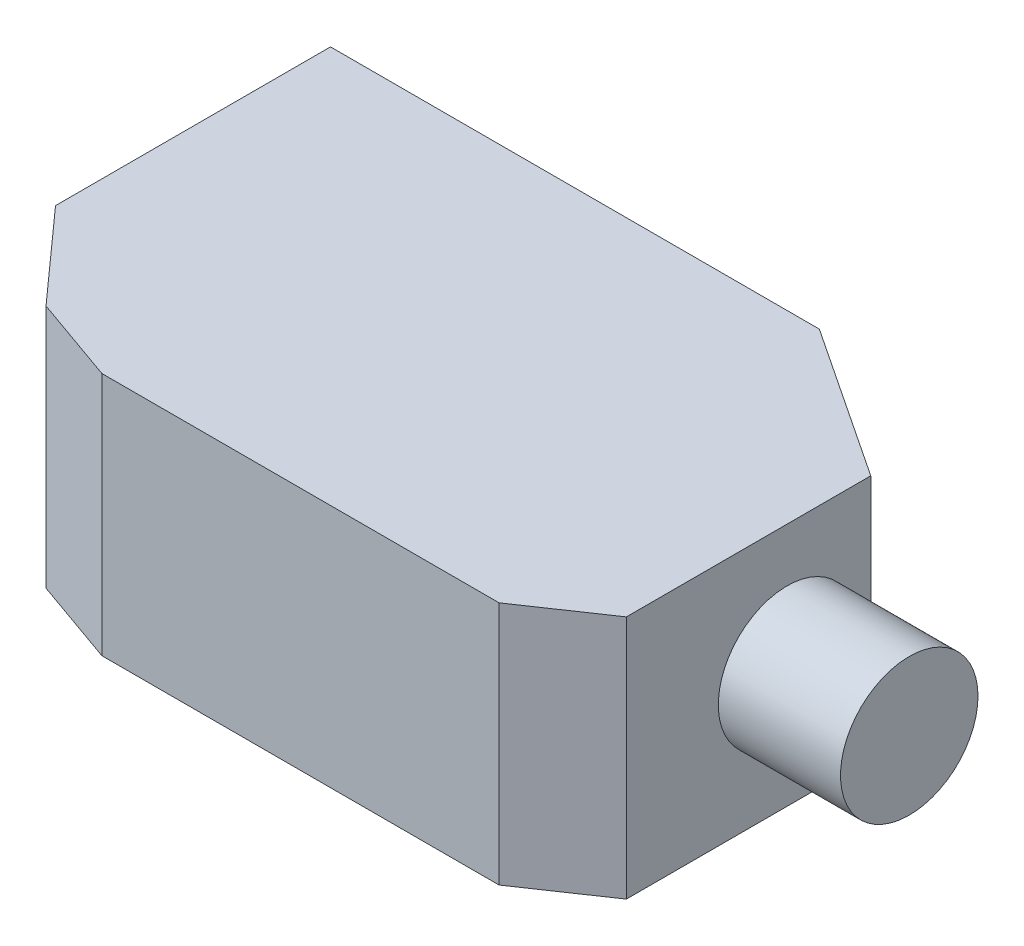
ISO-10303-21;
HEADER;
FILE_DESCRIPTION(('STEP AP214'),'2;1');
FILE_NAME('part.step','',(''),(''),'','','');
FILE_SCHEMA(('AUTOMOTIVE_DESIGN { 1 0 10303 214 1 1 1 1 }'));
ENDSEC;
DATA;
#1=APPLICATION_CONTEXT('core data for automotive mechanical design processes');
#2=APPLICATION_PROTOCOL_DEFINITION('international standard','automotive_design',2000,#1);
#3=PRODUCT_CONTEXT('',#1,'mechanical');
#4=PRODUCT('Part','Part','',(#3));
#5=PRODUCT_RELATED_PRODUCT_CATEGORY('part','',(#4));
#6=PRODUCT_DEFINITION_FORMATION('','',#4);
#7=PRODUCT_DEFINITION_CONTEXT('part definition',#1,'design');
#8=PRODUCT_DEFINITION('design','',#6,#7);
#9=PRODUCT_DEFINITION_SHAPE('','',#8);
#10=(LENGTH_UNIT() NAMED_UNIT(*) SI_UNIT(.MILLI.,.METRE.));
#11=(NAMED_UNIT(*) PLANE_ANGLE_UNIT() SI_UNIT($,.RADIAN.));
#12=(NAMED_UNIT(*) SI_UNIT($,.STERADIAN.) SOLID_ANGLE_UNIT());
#13=UNCERTAINTY_MEASURE_WITH_UNIT(LENGTH_MEASURE(1.E-05),#10,'distance_accuracy_value','');
#14=(GEOMETRIC_REPRESENTATION_CONTEXT(3) GLOBAL_UNCERTAINTY_ASSIGNED_CONTEXT((#13)) GLOBAL_UNIT_ASSIGNED_CONTEXT((#10,
#11,#12)) REPRESENTATION_CONTEXT('',''));
#15=CARTESIAN_POINT('',(0.,0.,0.));
#16=DIRECTION('',(0.,0.,1.));
#17=DIRECTION('',(1.,0.,0.));
#18=AXIS2_PLACEMENT_3D('',#15,#16,#17);
#19=CARTESIAN_POINT('',(0.,12.7,0.));
#20=DIRECTION('',(1.,0.,0.));
#21=DIRECTION('',(0.,0.,-1.));
#22=AXIS2_PLACEMENT_3D('',#19,#20,#21);
#23=PLANE('',#22);
#24=DIRECTION('',(0.,0.,1.));
#25=VECTOR('',#24,1.);
#26=CARTESIAN_POINT('',(0.,0.,0.));
#27=LINE('',#26,#25);
#28=CARTESIAN_POINT('',(0.,0.,0.));
#29=VERTEX_POINT('',#28);
#30=CARTESIAN_POINT('',(0.,0.,14.2875));
#31=VERTEX_POINT('',#30);
#32=EDGE_CURVE('E131',#29,#31,#27,.T.);
#33=ORIENTED_EDGE('',*,*,#32,.T.);
#34=DIRECTION('',(0.,-1.,0.));
#35=VECTOR('',#34,1.);
#36=CARTESIAN_POINT('',(0.,12.7,14.2875));
#37=LINE('',#36,#35);
#38=CARTESIAN_POINT('',(0.,12.7,14.2875));
#39=VERTEX_POINT('',#38);
#40=EDGE_CURVE('E36',#39,#31,#37,.T.);
#41=ORIENTED_EDGE('',*,*,#40,.F.);
#42=DIRECTION('',(0.,0.,1.));
#43=VECTOR('',#42,1.);
#44=CARTESIAN_POINT('',(0.,12.7,0.));
#45=LINE('',#44,#43);
#46=CARTESIAN_POINT('',(0.,12.7,0.));
#47=VERTEX_POINT('',#46);
#48=EDGE_CURVE('E146',#47,#39,#45,.T.);
#49=ORIENTED_EDGE('',*,*,#48,.F.);
#50=DIRECTION('',(0.,-1.,0.));
#51=VECTOR('',#50,1.);
#52=CARTESIAN_POINT('',(0.,12.7,0.));
#53=LINE('',#52,#51);
#54=EDGE_CURVE('E127',#47,#29,#53,.T.);
#55=ORIENTED_EDGE('',*,*,#54,.T.);
#56=EDGE_LOOP('',(#33,#41,#49,#55));
#57=FACE_BOUND('',#56,.T.);
#58=ADVANCED_FACE('F33',(#57),#23,.F.);
#59=CARTESIAN_POINT('',(0.,12.7,14.2875));
#60=DIRECTION('',(0.744726782819702,0.,-0.667369477089728));
#61=DIRECTION('',(-0.667369477089728,0.,-0.744726782819702));
#62=AXIS2_PLACEMENT_3D('',#59,#60,#61);
#63=PLANE('',#62);
#64=DIRECTION('',(0.667369477089728,0.,0.744726782819702));
#65=VECTOR('',#64,1.);
#66=CARTESIAN_POINT('',(0.,0.,14.2875));
#67=LINE('',#66,#65);
#68=CARTESIAN_POINT('',(4.26780291505819,0.,19.05));
#69=VERTEX_POINT('',#68);
#70=EDGE_CURVE('E134',#31,#69,#67,.T.);
#71=ORIENTED_EDGE('',*,*,#70,.T.);
#72=DIRECTION('',(0.,-1.,0.));
#73=VECTOR('',#72,1.);
#74=CARTESIAN_POINT('',(4.26780291505819,12.7,19.05));
#75=LINE('',#74,#73);
#76=CARTESIAN_POINT('',(4.26780291505819,12.7,19.05));
#77=VERTEX_POINT('',#76);
#78=EDGE_CURVE('E155',#77,#69,#75,.T.);
#79=ORIENTED_EDGE('',*,*,#78,.F.);
#80=DIRECTION('',(0.667369477089728,0.,0.744726782819702));
#81=VECTOR('',#80,1.);
#82=CARTESIAN_POINT('',(0.,12.7,14.2875));
#83=LINE('',#82,#81);
#84=EDGE_CURVE('E94',#39,#77,#83,.T.);
#85=ORIENTED_EDGE('',*,*,#84,.F.);
#86=ORIENTED_EDGE('',*,*,#40,.T.);
#87=EDGE_LOOP('',(#71,#79,#85,#86));
#88=FACE_BOUND('',#87,.T.);
#89=ADVANCED_FACE('F161',(#88),#63,.F.);
#90=CARTESIAN_POINT('',(8.75793097559277,12.7,20.6375));
#91=DIRECTION('',(0.333333333333333,0.,-0.942809041582064));
#92=DIRECTION('',(-0.942809041582064,0.,-0.333333333333333));
#93=AXIS2_PLACEMENT_3D('',#90,#91,#92);
#94=PLANE('',#93);
#95=DIRECTION('',(0.942809041582064,0.,0.333333333333333));
#96=VECTOR('',#95,1.);
#97=CARTESIAN_POINT('',(8.75793097559277,0.,20.6375));
#98=LINE('',#97,#96);
#99=CARTESIAN_POINT('',(8.75793097559277,0.,20.6375));
#100=VERTEX_POINT('',#99);
#101=EDGE_CURVE('E137',#69,#100,#98,.T.);
#102=ORIENTED_EDGE('',*,*,#101,.T.);
#103=DIRECTION('',(0.,-1.,0.));
#104=VECTOR('',#103,1.);
#105=CARTESIAN_POINT('',(8.75793097559277,12.7,20.6375));
#106=LINE('',#105,#104);
#107=CARTESIAN_POINT('',(8.75793097559277,12.7,20.6375));
#108=VERTEX_POINT('',#107);
#109=EDGE_CURVE('E153',#108,#100,#106,.T.);
#110=ORIENTED_EDGE('',*,*,#109,.F.);
#111=DIRECTION('',(0.942809041582064,0.,0.333333333333333));
#112=VECTOR('',#111,1.);
#113=CARTESIAN_POINT('',(8.75793097559277,12.7,20.6375));
#114=LINE('',#113,#112);
#115=EDGE_CURVE('E176',#77,#108,#114,.T.);
#116=ORIENTED_EDGE('',*,*,#115,.F.);
#117=ORIENTED_EDGE('',*,*,#78,.T.);
#118=EDGE_LOOP('',(#102,#110,#116,#117));
#119=FACE_BOUND('',#118,.T.);
#120=ADVANCED_FACE('F170',(#119),#94,.F.);
#121=CARTESIAN_POINT('',(29.3954309755928,12.7,20.6375));
#122=DIRECTION('',(0.,0.,-1.));
#123=DIRECTION('',(-1.,0.,0.));
#124=AXIS2_PLACEMENT_3D('',#121,#122,#123);
#125=PLANE('',#124);
#126=DIRECTION('',(1.,0.,0.));
#127=VECTOR('',#126,1.);
#128=CARTESIAN_POINT('',(29.3954309755928,0.,20.6375));
#129=LINE('',#128,#127);
#130=CARTESIAN_POINT('',(29.3954309755928,0.,20.6375));
#131=VERTEX_POINT('',#130);
#132=EDGE_CURVE('E139',#100,#131,#129,.T.);
#133=ORIENTED_EDGE('',*,*,#132,.T.);
#134=DIRECTION('',(0.,-1.,0.));
#135=VECTOR('',#134,1.);
#136=CARTESIAN_POINT('',(29.3954309755928,12.7,20.6375));
#137=LINE('',#136,#135);
#138=CARTESIAN_POINT('',(29.3954309755928,12.7,20.6375));
#139=VERTEX_POINT('',#138);
#140=EDGE_CURVE('E150',#139,#131,#137,.T.);
#141=ORIENTED_EDGE('',*,*,#140,.F.);
#142=DIRECTION('',(1.,0.,0.));
#143=VECTOR('',#142,1.);
#144=CARTESIAN_POINT('',(29.3954309755928,12.7,20.6375));
#145=LINE('',#144,#143);
#146=EDGE_CURVE('E175',#108,#139,#145,.T.);
#147=ORIENTED_EDGE('',*,*,#146,.F.);
#148=ORIENTED_EDGE('',*,*,#109,.T.);
#149=EDGE_LOOP('',(#133,#141,#147,#148));
#150=FACE_BOUND('',#149,.T.);
#151=ADVANCED_FACE('F173',(#150),#125,.F.);
#152=CARTESIAN_POINT('',(33.3375,12.7,17.9651418546892));
#153=DIRECTION('',(-0.561125069881533,0.,-0.827731028746926));
#154=DIRECTION('',(-0.827731028746926,0.,0.561125069881533));
#155=AXIS2_PLACEMENT_3D('',#152,#153,#154);
#156=PLANE('',#155);
#157=DIRECTION('',(0.827731028746926,0.,-0.561125069881533));
#158=VECTOR('',#157,1.);
#159=CARTESIAN_POINT('',(33.3375,0.,17.9651418546892));
#160=LINE('',#159,#158);
#161=CARTESIAN_POINT('',(33.3375,0.,17.9651418546892));
#162=VERTEX_POINT('',#161);
#163=EDGE_CURVE('E141',#131,#162,#160,.T.);
#164=ORIENTED_EDGE('',*,*,#163,.T.);
#165=DIRECTION('',(0.,-1.,0.));
#166=VECTOR('',#165,1.);
#167=CARTESIAN_POINT('',(33.3375,12.7,17.9651418546892));
#168=LINE('',#167,#166);
#169=CARTESIAN_POINT('',(33.3375,12.7,17.9651418546892));
#170=VERTEX_POINT('',#169);
#171=EDGE_CURVE('E122',#170,#162,#168,.T.);
#172=ORIENTED_EDGE('',*,*,#171,.F.);
#173=DIRECTION('',(0.827731028746926,0.,-0.561125069881533));
#174=VECTOR('',#173,1.);
#175=CARTESIAN_POINT('',(33.3375,12.7,17.9651418546892));
#176=LINE('',#175,#174);
#177=EDGE_CURVE('E113',#139,#170,#176,.T.);
#178=ORIENTED_EDGE('',*,*,#177,.F.);
#179=ORIENTED_EDGE('',*,*,#140,.T.);
#180=EDGE_LOOP('',(#164,#172,#178,#179));
#181=FACE_BOUND('',#180,.T.);
#182=ADVANCED_FACE('F194',(#181),#156,.F.);
#183=CARTESIAN_POINT('',(33.3375,12.7,5.2651418546892));
#184=DIRECTION('',(-1.,0.,0.));
#185=DIRECTION('',(0.,0.,1.));
#186=AXIS2_PLACEMENT_3D('',#183,#184,#185);
#187=PLANE('',#186);
#188=CARTESIAN_POINT('',(33.3375,6.35,9.6148918546892));
#189=DIRECTION('',(1.,0.,0.));
#190=DIRECTION('',(0.,0.,-1.));
#191=AXIS2_PLACEMENT_3D('',#188,#189,#190);
#192=CIRCLE('',#191,3.571875);
#193=CARTESIAN_POINT('',(33.3375,6.35,6.0430168546892));
#194=VERTEX_POINT('',#193);
#195=EDGE_CURVE('E11',#194,#194,#192,.T.);
#196=ORIENTED_EDGE('',*,*,#195,.F.);
#197=EDGE_LOOP('',(#196));
#198=FACE_BOUND('',#197,.T.);
#199=DIRECTION('',(0.,0.,-1.));
#200=VECTOR('',#199,1.);
#201=CARTESIAN_POINT('',(33.3375,0.,5.2651418546892));
#202=LINE('',#201,#200);
#203=CARTESIAN_POINT('',(33.3375,0.,5.2651418546892));
#204=VERTEX_POINT('',#203);
#205=EDGE_CURVE('E121',#162,#204,#202,.T.);
#206=ORIENTED_EDGE('',*,*,#205,.T.);
#207=DIRECTION('',(0.,-1.,0.));
#208=VECTOR('',#207,1.);
#209=CARTESIAN_POINT('',(33.3375,12.7,5.2651418546892));
#210=LINE('',#209,#208);
#211=CARTESIAN_POINT('',(33.3375,12.7,5.2651418546892));
#212=VERTEX_POINT('',#211);
#213=EDGE_CURVE('E118',#212,#204,#210,.T.);
#214=ORIENTED_EDGE('',*,*,#213,.F.);
#215=DIRECTION('',(0.,0.,-1.));
#216=VECTOR('',#215,1.);
#217=CARTESIAN_POINT('',(33.3375,12.7,5.2651418546892));
#218=LINE('',#217,#216);
#219=EDGE_CURVE('E107',#170,#212,#218,.T.);
#220=ORIENTED_EDGE('',*,*,#219,.F.);
#221=ORIENTED_EDGE('',*,*,#171,.T.);
#222=EDGE_LOOP('',(#206,#214,#220,#221));
#223=FACE_BOUND('',#222,.T.);
#224=ADVANCED_FACE('F119',(#198,#223),#187,.F.);
#225=CARTESIAN_POINT('',(25.4,12.7,0.));
#226=DIRECTION('',(-0.552770798392567,0.,0.833333333333333));
#227=DIRECTION('',(0.833333333333333,0.,0.552770798392567));
#228=AXIS2_PLACEMENT_3D('',#225,#226,#227);
#229=PLANE('',#228);
#230=DIRECTION('',(-0.833333333333333,0.,-0.552770798392567));
#231=VECTOR('',#230,1.);
#232=CARTESIAN_POINT('',(25.4,0.,0.));
#233=LINE('',#232,#231);
#234=CARTESIAN_POINT('',(25.4,0.,0.));
#235=VERTEX_POINT('',#234);
#236=EDGE_CURVE('E79',#204,#235,#233,.T.);
#237=ORIENTED_EDGE('',*,*,#236,.T.);
#238=DIRECTION('',(0.,-1.,0.));
#239=VECTOR('',#238,1.);
#240=CARTESIAN_POINT('',(25.4,12.7,0.));
#241=LINE('',#240,#239);
#242=CARTESIAN_POINT('',(25.4,12.7,0.));
#243=VERTEX_POINT('',#242);
#244=EDGE_CURVE('E123',#243,#235,#241,.T.);
#245=ORIENTED_EDGE('',*,*,#244,.F.);
#246=DIRECTION('',(-0.833333333333333,0.,-0.552770798392567));
#247=VECTOR('',#246,1.);
#248=CARTESIAN_POINT('',(25.4,12.7,0.));
#249=LINE('',#248,#247);
#250=EDGE_CURVE('E111',#212,#243,#249,.T.);
#251=ORIENTED_EDGE('',*,*,#250,.F.);
#252=ORIENTED_EDGE('',*,*,#213,.T.);
#253=EDGE_LOOP('',(#237,#245,#251,#252));
#254=FACE_BOUND('',#253,.T.);
#255=ADVANCED_FACE('F125',(#254),#229,.F.);
#256=CARTESIAN_POINT('',(0.,12.7,0.));
#257=DIRECTION('',(0.,0.,1.));
#258=DIRECTION('',(1.,0.,0.));
#259=AXIS2_PLACEMENT_3D('',#256,#257,#258);
#260=PLANE('',#259);
#261=DIRECTION('',(-1.,0.,0.));
#262=VECTOR('',#261,1.);
#263=CARTESIAN_POINT('',(0.,0.,0.));
#264=LINE('',#263,#262);
#265=EDGE_CURVE('E85',#235,#29,#264,.T.);
#266=ORIENTED_EDGE('',*,*,#265,.T.);
#267=ORIENTED_EDGE('',*,*,#54,.F.);
#268=DIRECTION('',(-1.,0.,0.));
#269=VECTOR('',#268,1.);
#270=CARTESIAN_POINT('',(0.,12.7,0.));
#271=LINE('',#270,#269);
#272=EDGE_CURVE('E50',#243,#47,#271,.T.);
#273=ORIENTED_EDGE('',*,*,#272,.F.);
#274=ORIENTED_EDGE('',*,*,#244,.T.);
#275=EDGE_LOOP('',(#266,#267,#273,#274));
#276=FACE_BOUND('',#275,.T.);
#277=ADVANCED_FACE('F200',(#276),#260,.F.);
#278=CARTESIAN_POINT('',(0.,12.7,0.));
#279=DIRECTION('',(0.,-1.,0.));
#280=DIRECTION('',(0.,0.,-1.));
#281=AXIS2_PLACEMENT_3D('',#278,#279,#280);
#282=PLANE('',#281);
#283=ORIENTED_EDGE('',*,*,#48,.T.);
#284=ORIENTED_EDGE('',*,*,#84,.T.);
#285=ORIENTED_EDGE('',*,*,#115,.T.);
#286=ORIENTED_EDGE('',*,*,#146,.T.);
#287=ORIENTED_EDGE('',*,*,#177,.T.);
#288=ORIENTED_EDGE('',*,*,#219,.T.);
#289=ORIENTED_EDGE('',*,*,#250,.T.);
#290=ORIENTED_EDGE('',*,*,#272,.T.);
#291=EDGE_LOOP('',(#283,#284,#285,#286,#287,#288,#289,#290));
#292=FACE_BOUND('',#291,.T.);
#293=ADVANCED_FACE('F109',(#292),#282,.F.);
#294=CARTESIAN_POINT('',(0.,0.,0.));
#295=DIRECTION('',(0.,-1.,0.));
#296=DIRECTION('',(0.,0.,-1.));
#297=AXIS2_PLACEMENT_3D('',#294,#295,#296);
#298=PLANE('',#297);
#299=ORIENTED_EDGE('',*,*,#32,.F.);
#300=ORIENTED_EDGE('',*,*,#265,.F.);
#301=ORIENTED_EDGE('',*,*,#236,.F.);
#302=ORIENTED_EDGE('',*,*,#205,.F.);
#303=ORIENTED_EDGE('',*,*,#163,.F.);
#304=ORIENTED_EDGE('',*,*,#132,.F.);
#305=ORIENTED_EDGE('',*,*,#101,.F.);
#306=ORIENTED_EDGE('',*,*,#70,.F.);
#307=EDGE_LOOP('',(#299,#300,#301,#302,#303,#304,#305,#306));
#308=FACE_BOUND('',#307,.T.);
#309=ADVANCED_FACE('F166',(#308),#298,.T.);
#310=CARTESIAN_POINT('',(39.6875,6.35,9.6148918546892));
#311=DIRECTION('',(-1.,0.,0.));
#312=DIRECTION('',(0.,0.,1.));
#313=AXIS2_PLACEMENT_3D('',#310,#311,#312);
#314=CYLINDRICAL_SURFACE('',#313,3.571875);
#315=CARTESIAN_POINT('',(39.6875,6.35,9.6148918546892));
#316=DIRECTION('',(1.,0.,0.));
#317=DIRECTION('',(0.,0.,-1.));
#318=AXIS2_PLACEMENT_3D('',#315,#316,#317);
#319=CIRCLE('',#318,3.571875);
#320=CARTESIAN_POINT('',(39.6875,6.35,6.0430168546892));
#321=VERTEX_POINT('',#320);
#322=EDGE_CURVE('E135',#321,#321,#319,.T.);
#323=ORIENTED_EDGE('',*,*,#322,.F.);
#324=EDGE_LOOP('',(#323));
#325=FACE_BOUND('',#324,.T.);
#326=ORIENTED_EDGE('',*,*,#195,.T.);
#327=EDGE_LOOP('',(#326));
#328=FACE_BOUND('',#327,.T.);
#329=ADVANCED_FACE('F187',(#325,#328),#314,.T.);
#330=CARTESIAN_POINT('',(39.6875,6.35,9.6148918546892));
#331=DIRECTION('',(1.,0.,0.));
#332=DIRECTION('',(0.,0.,-1.));
#333=AXIS2_PLACEMENT_3D('',#330,#331,#332);
#334=PLANE('',#333);
#335=ORIENTED_EDGE('',*,*,#322,.T.);
#336=EDGE_LOOP('',(#335));
#337=FACE_BOUND('',#336,.T.);
#338=ADVANCED_FACE('F185',(#337),#334,.T.);
#339=CLOSED_SHELL('',(#58,#89,#120,#151,#182,#224,#255,#277,#293,#309,#329,#338));
#340=MANIFOLD_SOLID_BREP('B2',#339);
#341=ADVANCED_BREP_SHAPE_REPRESENTATION('',(#18,#340),#14);
#342=SHAPE_DEFINITION_REPRESENTATION(#9,#341);
ENDSEC;
END-ISO-10303-21;
